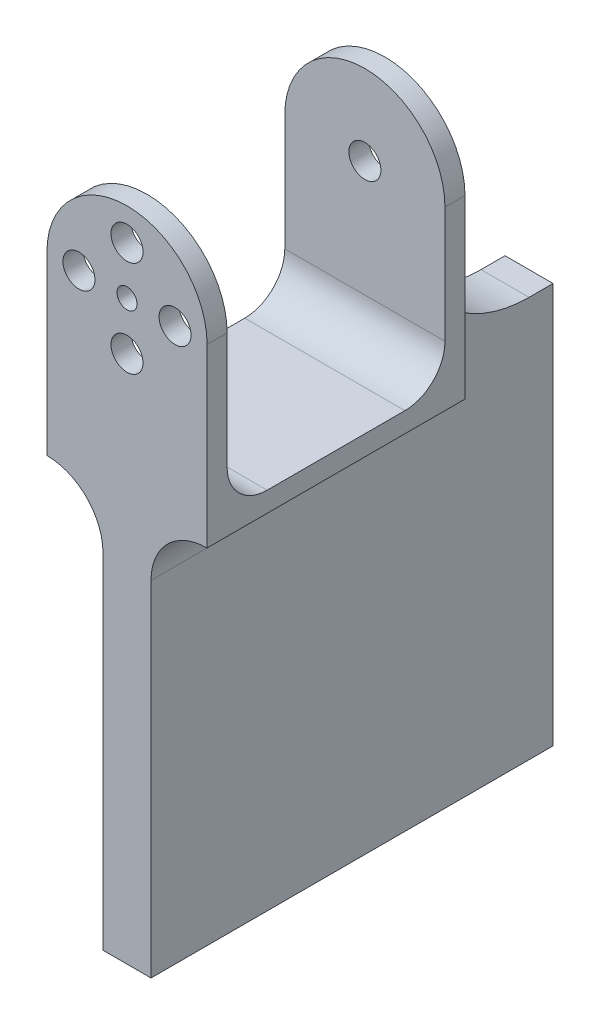
ISO-10303-21;
HEADER;
FILE_DESCRIPTION(('STEP AP214'),'2;1');
FILE_NAME('part.step','',(''),(''),'','','');
FILE_SCHEMA(('AUTOMOTIVE_DESIGN { 1 0 10303 214 1 1 1 1 }'));
ENDSEC;
DATA;
#1=APPLICATION_CONTEXT('core data for automotive mechanical design processes');
#2=APPLICATION_PROTOCOL_DEFINITION('international standard','automotive_design',2000,#1);
#3=PRODUCT_CONTEXT('',#1,'mechanical');
#4=PRODUCT('Part','Part','',(#3));
#5=PRODUCT_RELATED_PRODUCT_CATEGORY('part','',(#4));
#6=PRODUCT_DEFINITION_FORMATION('','',#4);
#7=PRODUCT_DEFINITION_CONTEXT('part definition',#1,'design');
#8=PRODUCT_DEFINITION('design','',#6,#7);
#9=PRODUCT_DEFINITION_SHAPE('','',#8);
#10=(LENGTH_UNIT() NAMED_UNIT(*) SI_UNIT(.MILLI.,.METRE.));
#11=(NAMED_UNIT(*) PLANE_ANGLE_UNIT() SI_UNIT($,.RADIAN.));
#12=(NAMED_UNIT(*) SI_UNIT($,.STERADIAN.) SOLID_ANGLE_UNIT());
#13=UNCERTAINTY_MEASURE_WITH_UNIT(LENGTH_MEASURE(1.E-05),#10,'distance_accuracy_value','');
#14=(GEOMETRIC_REPRESENTATION_CONTEXT(3) GLOBAL_UNCERTAINTY_ASSIGNED_CONTEXT((#13)) GLOBAL_UNIT_ASSIGNED_CONTEXT((#10,
#11,#12)) REPRESENTATION_CONTEXT('',''));
#15=CARTESIAN_POINT('',(0.,0.,0.));
#16=DIRECTION('',(0.,0.,1.));
#17=DIRECTION('',(1.,0.,0.));
#18=AXIS2_PLACEMENT_3D('',#15,#16,#17);
#19=CARTESIAN_POINT('',(0.,0.,2.5));
#20=DIRECTION('',(0.,0.,-1.));
#21=DIRECTION('',(-1.,0.,0.));
#22=AXIS2_PLACEMENT_3D('',#19,#20,#21);
#23=CYLINDRICAL_SURFACE('',#22,10.);
#24=CARTESIAN_POINT('',(0.,0.,0.));
#25=DIRECTION('',(0.,0.,-1.));
#26=DIRECTION('',(-1.,0.,0.));
#27=AXIS2_PLACEMENT_3D('',#24,#25,#26);
#28=CIRCLE('',#27,10.);
#29=CARTESIAN_POINT('',(-10.,0.,0.));
#30=VERTEX_POINT('',#29);
#31=CARTESIAN_POINT('',(10.,0.,0.));
#32=VERTEX_POINT('',#31);
#33=EDGE_CURVE('E326',#30,#32,#28,.T.);
#34=ORIENTED_EDGE('',*,*,#33,.F.);
#35=DIRECTION('',(0.,0.,1.));
#36=VECTOR('',#35,1.);
#37=CARTESIAN_POINT('',(-10.,0.,-29.732137494637));
#38=LINE('',#37,#36);
#39=CARTESIAN_POINT('',(-10.,0.,2.5));
#40=VERTEX_POINT('',#39);
#41=EDGE_CURVE('E277',#30,#40,#38,.T.);
#42=ORIENTED_EDGE('',*,*,#41,.T.);
#43=CARTESIAN_POINT('',(0.,0.,2.5));
#44=DIRECTION('',(0.,0.,-1.));
#45=DIRECTION('',(-1.,0.,0.));
#46=AXIS2_PLACEMENT_3D('',#43,#44,#45);
#47=CIRCLE('',#46,10.);
#48=CARTESIAN_POINT('',(10.,0.,2.5));
#49=VERTEX_POINT('',#48);
#50=EDGE_CURVE('E327',#40,#49,#47,.T.);
#51=ORIENTED_EDGE('',*,*,#50,.T.);
#52=DIRECTION('',(0.,0.,1.));
#53=VECTOR('',#52,1.);
#54=CARTESIAN_POINT('',(10.,0.,-29.732137494637));
#55=LINE('',#54,#53);
#56=EDGE_CURVE('E273',#32,#49,#55,.T.);
#57=ORIENTED_EDGE('',*,*,#56,.F.);
#58=EDGE_LOOP('',(#34,#42,#51,#57));
#59=FACE_BOUND('',#58,.T.);
#60=ADVANCED_FACE('F39',(#59),#23,.T.);
#61=CARTESIAN_POINT('',(0.,0.,2.5));
#62=DIRECTION('',(0.,0.,-1.));
#63=DIRECTION('',(-1.,0.,0.));
#64=AXIS2_PLACEMENT_3D('',#61,#62,#63);
#65=PLANE('',#64);
#66=CARTESIAN_POINT('',(6.,0.,2.5));
#67=DIRECTION('',(0.,0.,-1.));
#68=DIRECTION('',(-1.,0.,0.));
#69=AXIS2_PLACEMENT_3D('',#66,#67,#68);
#70=CIRCLE('',#69,2.);
#71=CARTESIAN_POINT('',(4.,0.,2.5));
#72=VERTEX_POINT('',#71);
#73=EDGE_CURVE('E306',#72,#72,#70,.T.);
#74=ORIENTED_EDGE('',*,*,#73,.T.);
#75=EDGE_LOOP('',(#74));
#76=FACE_BOUND('',#75,.T.);
#77=CARTESIAN_POINT('',(0.,-6.,2.5));
#78=DIRECTION('',(0.,0.,-1.));
#79=DIRECTION('',(-1.,0.,0.));
#80=AXIS2_PLACEMENT_3D('',#77,#78,#79);
#81=CIRCLE('',#80,2.);
#82=CARTESIAN_POINT('',(-2.,-6.,2.5));
#83=VERTEX_POINT('',#82);
#84=EDGE_CURVE('E302',#83,#83,#81,.T.);
#85=ORIENTED_EDGE('',*,*,#84,.T.);
#86=EDGE_LOOP('',(#85));
#87=FACE_BOUND('',#86,.T.);
#88=CARTESIAN_POINT('',(-6.,0.,2.5));
#89=DIRECTION('',(0.,0.,-1.));
#90=DIRECTION('',(-1.,0.,0.));
#91=AXIS2_PLACEMENT_3D('',#88,#89,#90);
#92=CIRCLE('',#91,2.);
#93=CARTESIAN_POINT('',(-8.,0.,2.5));
#94=VERTEX_POINT('',#93);
#95=EDGE_CURVE('E291',#94,#94,#92,.T.);
#96=ORIENTED_EDGE('',*,*,#95,.T.);
#97=EDGE_LOOP('',(#96));
#98=FACE_BOUND('',#97,.T.);
#99=CARTESIAN_POINT('',(0.,6.,2.5));
#100=DIRECTION('',(0.,0.,-1.));
#101=DIRECTION('',(-1.,0.,0.));
#102=AXIS2_PLACEMENT_3D('',#99,#100,#101);
#103=CIRCLE('',#102,2.);
#104=CARTESIAN_POINT('',(-2.,6.,2.5));
#105=VERTEX_POINT('',#104);
#106=EDGE_CURVE('E314',#105,#105,#103,.T.);
#107=ORIENTED_EDGE('',*,*,#106,.T.);
#108=EDGE_LOOP('',(#107));
#109=FACE_BOUND('',#108,.T.);
#110=CARTESIAN_POINT('',(0.,0.,2.5));
#111=DIRECTION('',(0.,0.,-1.));
#112=DIRECTION('',(-1.,0.,0.));
#113=AXIS2_PLACEMENT_3D('',#110,#111,#112);
#114=CIRCLE('',#113,1.25);
#115=CARTESIAN_POINT('',(-1.25,0.,2.5));
#116=VERTEX_POINT('',#115);
#117=EDGE_CURVE('E322',#116,#116,#114,.T.);
#118=ORIENTED_EDGE('',*,*,#117,.T.);
#119=EDGE_LOOP('',(#118));
#120=FACE_BOUND('',#119,.T.);
#121=ORIENTED_EDGE('',*,*,#50,.F.);
#122=DIRECTION('',(0.,-1.,0.));
#123=VECTOR('',#122,1.);
#124=CARTESIAN_POINT('',(-10.,0.,2.5));
#125=LINE('',#124,#123);
#126=CARTESIAN_POINT('',(-10.,-22.,2.5));
#127=VERTEX_POINT('',#126);
#128=EDGE_CURVE('E257',#40,#127,#125,.T.);
#129=ORIENTED_EDGE('',*,*,#128,.T.);
#130=CARTESIAN_POINT('',(-10.,-29.,2.5));
#131=DIRECTION('',(0.,0.,-1.));
#132=DIRECTION('',(-1.,0.,0.));
#133=AXIS2_PLACEMENT_3D('',#130,#131,#132);
#134=CIRCLE('',#133,7.);
#135=CARTESIAN_POINT('',(-3.,-29.,2.5));
#136=VERTEX_POINT('',#135);
#137=EDGE_CURVE('E373',#127,#136,#134,.T.);
#138=ORIENTED_EDGE('',*,*,#137,.T.);
#139=DIRECTION('',(0.,1.,0.));
#140=VECTOR('',#139,1.);
#141=CARTESIAN_POINT('',(-3.,-72.,2.5));
#142=LINE('',#141,#140);
#143=CARTESIAN_POINT('',(-3.,-72.,2.5));
#144=VERTEX_POINT('',#143);
#145=EDGE_CURVE('E205',#144,#136,#142,.T.);
#146=ORIENTED_EDGE('',*,*,#145,.F.);
#147=DIRECTION('',(-1.,0.,0.));
#148=VECTOR('',#147,1.);
#149=CARTESIAN_POINT('',(3.,-72.,2.5));
#150=LINE('',#149,#148);
#151=CARTESIAN_POINT('',(3.,-72.,2.5));
#152=VERTEX_POINT('',#151);
#153=EDGE_CURVE('E171',#152,#144,#150,.T.);
#154=ORIENTED_EDGE('',*,*,#153,.F.);
#155=DIRECTION('',(0.,1.,0.));
#156=VECTOR('',#155,1.);
#157=CARTESIAN_POINT('',(3.,-72.,2.5));
#158=LINE('',#157,#156);
#159=CARTESIAN_POINT('',(3.,-29.,2.5));
#160=VERTEX_POINT('',#159);
#161=EDGE_CURVE('E168',#152,#160,#158,.T.);
#162=ORIENTED_EDGE('',*,*,#161,.T.);
#163=CARTESIAN_POINT('',(10.,-29.,2.5));
#164=DIRECTION('',(0.,0.,-1.));
#165=DIRECTION('',(-1.,0.,0.));
#166=AXIS2_PLACEMENT_3D('',#163,#164,#165);
#167=CIRCLE('',#166,7.);
#168=CARTESIAN_POINT('',(10.,-22.,2.5));
#169=VERTEX_POINT('',#168);
#170=EDGE_CURVE('E376',#160,#169,#167,.T.);
#171=ORIENTED_EDGE('',*,*,#170,.T.);
#172=DIRECTION('',(0.,1.,0.));
#173=VECTOR('',#172,1.);
#174=CARTESIAN_POINT('',(10.,0.,2.5));
#175=LINE('',#174,#173);
#176=EDGE_CURVE('E258',#169,#49,#175,.T.);
#177=ORIENTED_EDGE('',*,*,#176,.T.);
#178=EDGE_LOOP('',(#121,#129,#138,#146,#154,#162,#171,#177));
#179=FACE_BOUND('',#178,.T.);
#180=ADVANCED_FACE('F409',(#76,#87,#98,#109,#120,#179),#65,.F.);
#181=CARTESIAN_POINT('',(0.,0.,0.));
#182=DIRECTION('',(0.,0.,-1.));
#183=DIRECTION('',(-1.,0.,0.));
#184=AXIS2_PLACEMENT_3D('',#181,#182,#183);
#185=PLANE('',#184);
#186=DIRECTION('',(0.,1.,0.));
#187=VECTOR('',#186,1.);
#188=CARTESIAN_POINT('',(10.,0.,0.));
#189=LINE('',#188,#187);
#190=CARTESIAN_POINT('',(10.,-14.5,0.));
#191=VERTEX_POINT('',#190);
#192=EDGE_CURVE('E270',#191,#32,#189,.T.);
#193=ORIENTED_EDGE('',*,*,#192,.F.);
#194=DIRECTION('',(1.,0.,0.));
#195=VECTOR('',#194,1.);
#196=CARTESIAN_POINT('',(0.,-14.5,0.));
#197=LINE('',#196,#195);
#198=CARTESIAN_POINT('',(-10.,-14.5,0.));
#199=VERTEX_POINT('',#198);
#200=EDGE_CURVE('E341',#191,#199,#197,.F.);
#201=ORIENTED_EDGE('',*,*,#200,.T.);
#202=DIRECTION('',(0.,-1.,0.));
#203=VECTOR('',#202,1.);
#204=CARTESIAN_POINT('',(-10.,0.,0.));
#205=LINE('',#204,#203);
#206=EDGE_CURVE('E262',#30,#199,#205,.T.);
#207=ORIENTED_EDGE('',*,*,#206,.F.);
#208=ORIENTED_EDGE('',*,*,#33,.T.);
#209=EDGE_LOOP('',(#193,#201,#207,#208));
#210=FACE_BOUND('',#209,.T.);
#211=CARTESIAN_POINT('',(6.,0.,0.));
#212=DIRECTION('',(0.,0.,-1.));
#213=DIRECTION('',(0.,1.,0.));
#214=AXIS2_PLACEMENT_3D('',#211,#212,#213);
#215=CIRCLE('',#214,2.);
#216=CARTESIAN_POINT('',(6.00000000000001,1.99999999999998,0.));
#217=VERTEX_POINT('',#216);
#218=EDGE_CURVE('E287',#217,#217,#215,.T.);
#219=ORIENTED_EDGE('',*,*,#218,.F.);
#220=EDGE_LOOP('',(#219));
#221=FACE_BOUND('',#220,.T.);
#222=CARTESIAN_POINT('',(0.,-6.,0.));
#223=DIRECTION('',(0.,0.,-1.));
#224=DIRECTION('',(1.,0.,0.));
#225=AXIS2_PLACEMENT_3D('',#222,#223,#224);
#226=CIRCLE('',#225,2.);
#227=CARTESIAN_POINT('',(2.,-6.,0.));
#228=VERTEX_POINT('',#227);
#229=EDGE_CURVE('E292',#228,#228,#226,.T.);
#230=ORIENTED_EDGE('',*,*,#229,.F.);
#231=EDGE_LOOP('',(#230));
#232=FACE_BOUND('',#231,.T.);
#233=CARTESIAN_POINT('',(-6.,0.,0.));
#234=DIRECTION('',(0.,0.,-1.));
#235=DIRECTION('',(0.,-1.,0.));
#236=AXIS2_PLACEMENT_3D('',#233,#234,#235);
#237=CIRCLE('',#236,2.);
#238=CARTESIAN_POINT('',(-6.00000000000002,-1.99999999999994,0.));
#239=VERTEX_POINT('',#238);
#240=EDGE_CURVE('E286',#239,#239,#237,.T.);
#241=ORIENTED_EDGE('',*,*,#240,.F.);
#242=EDGE_LOOP('',(#241));
#243=FACE_BOUND('',#242,.T.);
#244=CARTESIAN_POINT('',(0.,6.,0.));
#245=DIRECTION('',(0.,0.,-1.));
#246=DIRECTION('',(-1.,0.,0.));
#247=AXIS2_PLACEMENT_3D('',#244,#245,#246);
#248=CIRCLE('',#247,2.);
#249=CARTESIAN_POINT('',(-2.,6.,0.));
#250=VERTEX_POINT('',#249);
#251=EDGE_CURVE('E310',#250,#250,#248,.T.);
#252=ORIENTED_EDGE('',*,*,#251,.F.);
#253=EDGE_LOOP('',(#252));
#254=FACE_BOUND('',#253,.T.);
#255=CARTESIAN_POINT('',(0.,0.,0.));
#256=DIRECTION('',(0.,0.,-1.));
#257=DIRECTION('',(-1.,0.,0.));
#258=AXIS2_PLACEMENT_3D('',#255,#256,#257);
#259=CIRCLE('',#258,1.25);
#260=CARTESIAN_POINT('',(-1.25,0.,0.));
#261=VERTEX_POINT('',#260);
#262=EDGE_CURVE('E318',#261,#261,#259,.T.);
#263=ORIENTED_EDGE('',*,*,#262,.F.);
#264=EDGE_LOOP('',(#263));
#265=FACE_BOUND('',#264,.T.);
#266=ADVANCED_FACE('F418',(#210,#221,#232,#243,#254,#265),#185,.T.);
#267=CARTESIAN_POINT('',(0.,0.,10.));
#268=DIRECTION('',(0.,0.,-1.));
#269=DIRECTION('',(-1.,0.,0.));
#270=AXIS2_PLACEMENT_3D('',#267,#268,#269);
#271=CYLINDRICAL_SURFACE('',#270,1.25);
#272=ORIENTED_EDGE('',*,*,#262,.T.);
#273=EDGE_LOOP('',(#272));
#274=FACE_BOUND('',#273,.T.);
#275=ORIENTED_EDGE('',*,*,#117,.F.);
#276=EDGE_LOOP('',(#275));
#277=FACE_BOUND('',#276,.T.);
#278=ADVANCED_FACE('F600',(#274,#277),#271,.F.);
#279=CARTESIAN_POINT('',(0.,6.,10.));
#280=DIRECTION('',(0.,0.,-1.));
#281=DIRECTION('',(-1.,0.,0.));
#282=AXIS2_PLACEMENT_3D('',#279,#280,#281);
#283=CYLINDRICAL_SURFACE('',#282,2.);
#284=ORIENTED_EDGE('',*,*,#251,.T.);
#285=EDGE_LOOP('',(#284));
#286=FACE_BOUND('',#285,.T.);
#287=ORIENTED_EDGE('',*,*,#106,.F.);
#288=EDGE_LOOP('',(#287));
#289=FACE_BOUND('',#288,.T.);
#290=ADVANCED_FACE('F648',(#286,#289),#283,.F.);
#291=CARTESIAN_POINT('',(-6.,0.,10.));
#292=DIRECTION('',(0.,0.,-1.));
#293=DIRECTION('',(-1.,0.,0.));
#294=AXIS2_PLACEMENT_3D('',#291,#292,#293);
#295=CYLINDRICAL_SURFACE('',#294,2.);
#296=ORIENTED_EDGE('',*,*,#240,.T.);
#297=EDGE_LOOP('',(#296));
#298=FACE_BOUND('',#297,.T.);
#299=ORIENTED_EDGE('',*,*,#95,.F.);
#300=EDGE_LOOP('',(#299));
#301=FACE_BOUND('',#300,.T.);
#302=ADVANCED_FACE('F638',(#298,#301),#295,.F.);
#303=CARTESIAN_POINT('',(0.,-6.,10.));
#304=DIRECTION('',(0.,0.,-1.));
#305=DIRECTION('',(-1.,0.,0.));
#306=AXIS2_PLACEMENT_3D('',#303,#304,#305);
#307=CYLINDRICAL_SURFACE('',#306,2.);
#308=ORIENTED_EDGE('',*,*,#229,.T.);
#309=EDGE_LOOP('',(#308));
#310=FACE_BOUND('',#309,.T.);
#311=ORIENTED_EDGE('',*,*,#84,.F.);
#312=EDGE_LOOP('',(#311));
#313=FACE_BOUND('',#312,.T.);
#314=ADVANCED_FACE('F628',(#310,#313),#307,.F.);
#315=CARTESIAN_POINT('',(6.,0.,10.));
#316=DIRECTION('',(0.,0.,-1.));
#317=DIRECTION('',(-1.,0.,0.));
#318=AXIS2_PLACEMENT_3D('',#315,#316,#317);
#319=CYLINDRICAL_SURFACE('',#318,2.);
#320=ORIENTED_EDGE('',*,*,#218,.T.);
#321=EDGE_LOOP('',(#320));
#322=FACE_BOUND('',#321,.T.);
#323=ORIENTED_EDGE('',*,*,#73,.F.);
#324=EDGE_LOOP('',(#323));
#325=FACE_BOUND('',#324,.T.);
#326=ADVANCED_FACE('F545',(#322,#325),#319,.F.);
#327=CARTESIAN_POINT('',(-10.,0.,-29.732137494637));
#328=DIRECTION('',(-1.,0.,0.));
#329=DIRECTION('',(0.,-1.,0.));
#330=AXIS2_PLACEMENT_3D('',#327,#328,#329);
#331=PLANE('',#330);
#332=ORIENTED_EDGE('',*,*,#41,.F.);
#333=ORIENTED_EDGE('',*,*,#206,.T.);
#334=CARTESIAN_POINT('',(-10.,-14.5,-5.));
#335=DIRECTION('',(-1.,0.,0.));
#336=DIRECTION('',(0.,-1.,0.));
#337=AXIS2_PLACEMENT_3D('',#334,#335,#336);
#338=CIRCLE('',#337,5.);
#339=CARTESIAN_POINT('',(-10.,-19.5,-5.));
#340=VERTEX_POINT('',#339);
#341=EDGE_CURVE('E351',#199,#340,#338,.F.);
#342=ORIENTED_EDGE('',*,*,#341,.T.);
#343=DIRECTION('',(0.,0.,1.));
#344=VECTOR('',#343,1.);
#345=CARTESIAN_POINT('',(-10.,-19.5,-27.2));
#346=LINE('',#345,#344);
#347=CARTESIAN_POINT('',(-10.,-19.5,-22.2));
#348=VERTEX_POINT('',#347);
#349=EDGE_CURVE('E253',#348,#340,#346,.T.);
#350=ORIENTED_EDGE('',*,*,#349,.F.);
#351=CARTESIAN_POINT('',(-10.,-14.5,-22.2));
#352=DIRECTION('',(-1.,0.,0.));
#353=DIRECTION('',(0.,-1.,0.));
#354=AXIS2_PLACEMENT_3D('',#351,#352,#353);
#355=CIRCLE('',#354,5.);
#356=CARTESIAN_POINT('',(-10.,-14.5,-27.2));
#357=VERTEX_POINT('',#356);
#358=EDGE_CURVE('E357',#348,#357,#355,.F.);
#359=ORIENTED_EDGE('',*,*,#358,.T.);
#360=DIRECTION('',(0.,1.,0.));
#361=VECTOR('',#360,1.);
#362=CARTESIAN_POINT('',(-10.,0.,-27.2));
#363=LINE('',#362,#361);
#364=CARTESIAN_POINT('',(-10.,0.,-27.2));
#365=VERTEX_POINT('',#364);
#366=EDGE_CURVE('E225',#357,#365,#363,.T.);
#367=ORIENTED_EDGE('',*,*,#366,.T.);
#368=DIRECTION('',(0.,0.,1.));
#369=VECTOR('',#368,1.);
#370=CARTESIAN_POINT('',(-10.,0.,-29.7));
#371=LINE('',#370,#369);
#372=CARTESIAN_POINT('',(-10.,0.,-29.7));
#373=VERTEX_POINT('',#372);
#374=EDGE_CURVE('E232',#373,#365,#371,.T.);
#375=ORIENTED_EDGE('',*,*,#374,.F.);
#376=DIRECTION('',(0.,1.,0.));
#377=VECTOR('',#376,1.);
#378=CARTESIAN_POINT('',(-10.,0.,-29.7));
#379=LINE('',#378,#377);
#380=CARTESIAN_POINT('',(-10.,-22.,-29.7));
#381=VERTEX_POINT('',#380);
#382=EDGE_CURVE('E229',#381,#373,#379,.T.);
#383=ORIENTED_EDGE('',*,*,#382,.F.);
#384=DIRECTION('',(0.,0.,1.));
#385=VECTOR('',#384,1.);
#386=CARTESIAN_POINT('',(-10.,-22.,-29.732137494637));
#387=LINE('',#386,#385);
#388=EDGE_CURVE('E269',#381,#127,#387,.T.);
#389=ORIENTED_EDGE('',*,*,#388,.T.);
#390=ORIENTED_EDGE('',*,*,#128,.F.);
#391=EDGE_LOOP('',(#332,#333,#342,#350,#359,#367,#375,#383,#389,#390));
#392=FACE_BOUND('',#391,.T.);
#393=ADVANCED_FACE('F405',(#392),#331,.T.);
#394=CARTESIAN_POINT('',(10.,0.,-29.732137494637));
#395=DIRECTION('',(1.,0.,0.));
#396=DIRECTION('',(0.,1.,0.));
#397=AXIS2_PLACEMENT_3D('',#394,#395,#396);
#398=PLANE('',#397);
#399=DIRECTION('',(0.,0.,1.));
#400=VECTOR('',#399,1.);
#401=CARTESIAN_POINT('',(10.,-22.,-29.732137494637));
#402=LINE('',#401,#400);
#403=CARTESIAN_POINT('',(10.,-22.,-29.7));
#404=VERTEX_POINT('',#403);
#405=EDGE_CURVE('E274',#404,#169,#402,.T.);
#406=ORIENTED_EDGE('',*,*,#405,.F.);
#407=DIRECTION('',(0.,-1.,0.));
#408=VECTOR('',#407,1.);
#409=CARTESIAN_POINT('',(10.,0.,-29.7));
#410=LINE('',#409,#408);
#411=CARTESIAN_POINT('',(10.,0.,-29.7));
#412=VERTEX_POINT('',#411);
#413=EDGE_CURVE('E224',#412,#404,#410,.T.);
#414=ORIENTED_EDGE('',*,*,#413,.F.);
#415=DIRECTION('',(0.,0.,1.));
#416=VECTOR('',#415,1.);
#417=CARTESIAN_POINT('',(10.,0.,-29.7));
#418=LINE('',#417,#416);
#419=CARTESIAN_POINT('',(10.,0.,-27.2));
#420=VERTEX_POINT('',#419);
#421=EDGE_CURVE('E245',#412,#420,#418,.T.);
#422=ORIENTED_EDGE('',*,*,#421,.T.);
#423=DIRECTION('',(0.,-1.,0.));
#424=VECTOR('',#423,1.);
#425=CARTESIAN_POINT('',(10.,0.,-27.2));
#426=LINE('',#425,#424);
#427=CARTESIAN_POINT('',(10.,-14.5,-27.2));
#428=VERTEX_POINT('',#427);
#429=EDGE_CURVE('E236',#420,#428,#426,.T.);
#430=ORIENTED_EDGE('',*,*,#429,.T.);
#431=CARTESIAN_POINT('',(10.,-14.5,-22.2));
#432=DIRECTION('',(1.,0.,0.));
#433=DIRECTION('',(0.,1.,0.));
#434=AXIS2_PLACEMENT_3D('',#431,#432,#433);
#435=CIRCLE('',#434,5.);
#436=CARTESIAN_POINT('',(10.,-19.5,-22.2));
#437=VERTEX_POINT('',#436);
#438=EDGE_CURVE('E354',#428,#437,#435,.F.);
#439=ORIENTED_EDGE('',*,*,#438,.T.);
#440=DIRECTION('',(0.,0.,1.));
#441=VECTOR('',#440,1.);
#442=CARTESIAN_POINT('',(10.,-19.5,-27.2));
#443=LINE('',#442,#441);
#444=CARTESIAN_POINT('',(10.,-19.5,-5.));
#445=VERTEX_POINT('',#444);
#446=EDGE_CURVE('E249',#437,#445,#443,.T.);
#447=ORIENTED_EDGE('',*,*,#446,.T.);
#448=CARTESIAN_POINT('',(10.,-14.5,-5.));
#449=DIRECTION('',(1.,0.,0.));
#450=DIRECTION('',(0.,1.,0.));
#451=AXIS2_PLACEMENT_3D('',#448,#449,#450);
#452=CIRCLE('',#451,5.);
#453=EDGE_CURVE('E348',#445,#191,#452,.F.);
#454=ORIENTED_EDGE('',*,*,#453,.T.);
#455=ORIENTED_EDGE('',*,*,#192,.T.);
#456=ORIENTED_EDGE('',*,*,#56,.T.);
#457=ORIENTED_EDGE('',*,*,#176,.F.);
#458=EDGE_LOOP('',(#406,#414,#422,#430,#439,#447,#454,#455,#456,#457));
#459=FACE_BOUND('',#458,.T.);
#460=ADVANCED_FACE('F529',(#459),#398,.T.);
#461=CARTESIAN_POINT('',(-10.,-19.5,-27.2));
#462=DIRECTION('',(0.,-1.,0.));
#463=DIRECTION('',(1.,0.,0.));
#464=AXIS2_PLACEMENT_3D('',#461,#462,#463);
#465=PLANE('',#464);
#466=ORIENTED_EDGE('',*,*,#349,.T.);
#467=DIRECTION('',(1.,0.,0.));
#468=VECTOR('',#467,1.);
#469=CARTESIAN_POINT('',(-10.,-19.5,-5.));
#470=LINE('',#469,#468);
#471=EDGE_CURVE('E337',#340,#445,#470,.T.);
#472=ORIENTED_EDGE('',*,*,#471,.T.);
#473=ORIENTED_EDGE('',*,*,#446,.F.);
#474=DIRECTION('',(1.,0.,0.));
#475=VECTOR('',#474,1.);
#476=CARTESIAN_POINT('',(-10.,-19.5,-22.2));
#477=LINE('',#476,#475);
#478=EDGE_CURVE('E331',#437,#348,#477,.F.);
#479=ORIENTED_EDGE('',*,*,#478,.T.);
#480=EDGE_LOOP('',(#466,#472,#473,#479));
#481=FACE_BOUND('',#480,.T.);
#482=ADVANCED_FACE('F427',(#481),#465,.F.);
#483=CARTESIAN_POINT('',(0.,0.,-27.2));
#484=DIRECTION('',(0.,0.,-1.));
#485=DIRECTION('',(-1.,0.,0.));
#486=AXIS2_PLACEMENT_3D('',#483,#484,#485);
#487=PLANE('',#486);
#488=CARTESIAN_POINT('',(0.,0.,-27.2));
#489=DIRECTION('',(0.,0.,-1.));
#490=DIRECTION('',(-1.,0.,0.));
#491=AXIS2_PLACEMENT_3D('',#488,#489,#490);
#492=CIRCLE('',#491,2.);
#493=CARTESIAN_POINT('',(-2.,0.,-27.2));
#494=VERTEX_POINT('',#493);
#495=EDGE_CURVE('E211',#494,#494,#492,.T.);
#496=ORIENTED_EDGE('',*,*,#495,.T.);
#497=EDGE_LOOP('',(#496));
#498=FACE_BOUND('',#497,.T.);
#499=ORIENTED_EDGE('',*,*,#366,.F.);
#500=DIRECTION('',(1.,0.,0.));
#501=VECTOR('',#500,1.);
#502=CARTESIAN_POINT('',(10.,-14.5,-27.2));
#503=LINE('',#502,#501);
#504=EDGE_CURVE('E344',#357,#428,#503,.T.);
#505=ORIENTED_EDGE('',*,*,#504,.T.);
#506=ORIENTED_EDGE('',*,*,#429,.F.);
#507=CARTESIAN_POINT('',(0.,0.,-27.2));
#508=DIRECTION('',(0.,0.,-1.));
#509=DIRECTION('',(-1.,0.,0.));
#510=AXIS2_PLACEMENT_3D('',#507,#508,#509);
#511=CIRCLE('',#510,10.);
#512=EDGE_CURVE('E216',#365,#420,#511,.T.);
#513=ORIENTED_EDGE('',*,*,#512,.F.);
#514=EDGE_LOOP('',(#499,#505,#506,#513));
#515=FACE_BOUND('',#514,.T.);
#516=ADVANCED_FACE('F436',(#498,#515),#487,.F.);
#517=CARTESIAN_POINT('',(0.,0.,-29.7));
#518=DIRECTION('',(0.,0.,-1.));
#519=DIRECTION('',(-1.,0.,0.));
#520=AXIS2_PLACEMENT_3D('',#517,#518,#519);
#521=PLANE('',#520);
#522=DIRECTION('',(0.,-1.,0.));
#523=VECTOR('',#522,1.);
#524=CARTESIAN_POINT('',(3.,-72.,-29.7));
#525=LINE('',#524,#523);
#526=CARTESIAN_POINT('',(3.,-7.00000000000001,-29.7));
#527=VERTEX_POINT('',#526);
#528=CARTESIAN_POINT('',(3.,-29.,-29.7));
#529=VERTEX_POINT('',#528);
#530=EDGE_CURVE('E55',#527,#529,#525,.T.);
#531=ORIENTED_EDGE('',*,*,#530,.F.);
#532=DIRECTION('',(1.,0.,0.));
#533=VECTOR('',#532,1.);
#534=CARTESIAN_POINT('',(0.,-7.,-29.7));
#535=LINE('',#534,#533);
#536=CARTESIAN_POINT('',(-3.,-7.00000000000001,-29.7));
#537=VERTEX_POINT('',#536);
#538=EDGE_CURVE('E386',#527,#537,#535,.F.);
#539=ORIENTED_EDGE('',*,*,#538,.T.);
#540=DIRECTION('',(0.,1.,0.));
#541=VECTOR('',#540,1.);
#542=CARTESIAN_POINT('',(-3.,-72.,-29.7));
#543=LINE('',#542,#541);
#544=CARTESIAN_POINT('',(-3.,-29.,-29.7));
#545=VERTEX_POINT('',#544);
#546=EDGE_CURVE('E62',#545,#537,#543,.T.);
#547=ORIENTED_EDGE('',*,*,#546,.F.);
#548=CARTESIAN_POINT('',(-10.,-29.,-29.7));
#549=DIRECTION('',(0.,0.,-1.));
#550=DIRECTION('',(-1.,0.,0.));
#551=AXIS2_PLACEMENT_3D('',#548,#549,#550);
#552=CIRCLE('',#551,7.);
#553=EDGE_CURVE('E370',#545,#381,#552,.F.);
#554=ORIENTED_EDGE('',*,*,#553,.T.);
#555=ORIENTED_EDGE('',*,*,#382,.T.);
#556=CARTESIAN_POINT('',(0.,0.,-29.7));
#557=DIRECTION('',(0.,0.,-1.));
#558=DIRECTION('',(-1.,0.,0.));
#559=AXIS2_PLACEMENT_3D('',#556,#557,#558);
#560=CIRCLE('',#559,10.);
#561=EDGE_CURVE('E220',#373,#412,#560,.T.);
#562=ORIENTED_EDGE('',*,*,#561,.T.);
#563=ORIENTED_EDGE('',*,*,#413,.T.);
#564=CARTESIAN_POINT('',(10.,-29.,-29.7));
#565=DIRECTION('',(0.,0.,-1.));
#566=DIRECTION('',(-1.,0.,0.));
#567=AXIS2_PLACEMENT_3D('',#564,#565,#566);
#568=CIRCLE('',#567,7.);
#569=EDGE_CURVE('E379',#404,#529,#568,.F.);
#570=ORIENTED_EDGE('',*,*,#569,.T.);
#571=EDGE_LOOP('',(#531,#539,#547,#554,#555,#562,#563,#570));
#572=FACE_BOUND('',#571,.T.);
#573=CARTESIAN_POINT('',(0.,0.,-29.7));
#574=DIRECTION('',(0.,0.,-1.));
#575=DIRECTION('',(-1.,0.,0.));
#576=AXIS2_PLACEMENT_3D('',#573,#574,#575);
#577=CIRCLE('',#576,2.);
#578=CARTESIAN_POINT('',(-2.,0.,-29.7));
#579=VERTEX_POINT('',#578);
#580=EDGE_CURVE('E212',#579,#579,#577,.T.);
#581=ORIENTED_EDGE('',*,*,#580,.F.);
#582=EDGE_LOOP('',(#581));
#583=FACE_BOUND('',#582,.T.);
#584=ADVANCED_FACE('F394',(#572,#583),#521,.T.);
#585=CARTESIAN_POINT('',(0.,0.,-29.7));
#586=DIRECTION('',(0.,0.,1.));
#587=DIRECTION('',(1.,0.,0.));
#588=AXIS2_PLACEMENT_3D('',#585,#586,#587);
#589=CYLINDRICAL_SURFACE('',#588,10.);
#590=ORIENTED_EDGE('',*,*,#512,.T.);
#591=ORIENTED_EDGE('',*,*,#421,.F.);
#592=ORIENTED_EDGE('',*,*,#561,.F.);
#593=ORIENTED_EDGE('',*,*,#374,.T.);
#594=EDGE_LOOP('',(#590,#591,#592,#593));
#595=FACE_BOUND('',#594,.T.);
#596=ADVANCED_FACE('F439',(#595),#589,.T.);
#597=CARTESIAN_POINT('',(0.,0.,-29.7));
#598=DIRECTION('',(0.,0.,1.));
#599=DIRECTION('',(1.,0.,0.));
#600=AXIS2_PLACEMENT_3D('',#597,#598,#599);
#601=CYLINDRICAL_SURFACE('',#600,2.);
#602=ORIENTED_EDGE('',*,*,#580,.T.);
#603=EDGE_LOOP('',(#602));
#604=FACE_BOUND('',#603,.T.);
#605=ORIENTED_EDGE('',*,*,#495,.F.);
#606=EDGE_LOOP('',(#605));
#607=FACE_BOUND('',#606,.T.);
#608=ADVANCED_FACE('F467',(#604,#607),#601,.F.);
#609=CARTESIAN_POINT('',(-10.,-14.5,-5.));
#610=DIRECTION('',(1.,0.,0.));
#611=DIRECTION('',(0.,1.,0.));
#612=AXIS2_PLACEMENT_3D('',#609,#610,#611);
#613=CYLINDRICAL_SURFACE('',#612,5.);
#614=ORIENTED_EDGE('',*,*,#341,.F.);
#615=ORIENTED_EDGE('',*,*,#200,.F.);
#616=ORIENTED_EDGE('',*,*,#453,.F.);
#617=ORIENTED_EDGE('',*,*,#471,.F.);
#618=EDGE_LOOP('',(#614,#615,#616,#617));
#619=FACE_BOUND('',#618,.T.);
#620=ADVANCED_FACE('F422',(#619),#613,.F.);
#621=CARTESIAN_POINT('',(0.,-14.5,-22.2));
#622=DIRECTION('',(-1.,0.,0.));
#623=DIRECTION('',(0.,-1.,0.));
#624=AXIS2_PLACEMENT_3D('',#621,#622,#623);
#625=CYLINDRICAL_SURFACE('',#624,5.);
#626=ORIENTED_EDGE('',*,*,#358,.F.);
#627=ORIENTED_EDGE('',*,*,#478,.F.);
#628=ORIENTED_EDGE('',*,*,#438,.F.);
#629=ORIENTED_EDGE('',*,*,#504,.F.);
#630=EDGE_LOOP('',(#626,#627,#628,#629));
#631=FACE_BOUND('',#630,.T.);
#632=ADVANCED_FACE('F431',(#631),#625,.F.);
#633=CARTESIAN_POINT('',(3.,-72.,-29.7));
#634=DIRECTION('',(-1.,0.,0.));
#635=DIRECTION('',(0.,0.,1.));
#636=AXIS2_PLACEMENT_3D('',#633,#634,#635);
#637=PLANE('',#636);
#638=ORIENTED_EDGE('',*,*,#530,.T.);
#639=DIRECTION('',(0.,0.,1.));
#640=VECTOR('',#639,1.);
#641=CARTESIAN_POINT('',(3.,-29.,-29.7));
#642=LINE('',#641,#640);
#643=EDGE_CURVE('E367',#529,#160,#642,.T.);
#644=ORIENTED_EDGE('',*,*,#643,.T.);
#645=ORIENTED_EDGE('',*,*,#161,.F.);
#646=DIRECTION('',(0.,0.,1.));
#647=VECTOR('',#646,1.);
#648=CARTESIAN_POINT('',(3.,-72.,-29.7));
#649=LINE('',#648,#647);
#650=CARTESIAN_POINT('',(3.,-72.,-47.7));
#651=VERTEX_POINT('',#650);
#652=EDGE_CURVE('E160',#651,#152,#649,.T.);
#653=ORIENTED_EDGE('',*,*,#652,.F.);
#654=DIRECTION('',(0.,-1.,0.));
#655=VECTOR('',#654,1.);
#656=CARTESIAN_POINT('',(3.,-72.,-47.7));
#657=LINE('',#656,#655);
#658=CARTESIAN_POINT('',(3.,-22.,-47.7));
#659=VERTEX_POINT('',#658);
#660=EDGE_CURVE('E165',#659,#651,#657,.T.);
#661=ORIENTED_EDGE('',*,*,#660,.F.);
#662=DIRECTION('',(0.,0.,1.));
#663=VECTOR('',#662,1.);
#664=CARTESIAN_POINT('',(3.,-22.,-47.7));
#665=LINE('',#664,#663);
#666=CARTESIAN_POINT('',(3.,-22.,-44.7));
#667=VERTEX_POINT('',#666);
#668=EDGE_CURVE('E195',#659,#667,#665,.T.);
#669=ORIENTED_EDGE('',*,*,#668,.T.);
#670=CARTESIAN_POINT('',(3.,-7.00000000000001,-44.7));
#671=DIRECTION('',(-1.,0.,0.));
#672=DIRECTION('',(0.,0.,1.));
#673=AXIS2_PLACEMENT_3D('',#670,#671,#672);
#674=CIRCLE('',#673,15.);
#675=EDGE_CURVE('E48',#667,#527,#674,.T.);
#676=ORIENTED_EDGE('',*,*,#675,.T.);
#677=EDGE_LOOP('',(#638,#644,#645,#653,#661,#669,#676));
#678=FACE_BOUND('',#677,.T.);
#679=ADVANCED_FACE('F162',(#678),#637,.F.);
#680=CARTESIAN_POINT('',(-3.,-72.,-29.7));
#681=DIRECTION('',(1.,0.,0.));
#682=DIRECTION('',(0.,0.,-1.));
#683=AXIS2_PLACEMENT_3D('',#680,#681,#682);
#684=PLANE('',#683);
#685=ORIENTED_EDGE('',*,*,#145,.T.);
#686=DIRECTION('',(0.,0.,-1.));
#687=VECTOR('',#686,1.);
#688=CARTESIAN_POINT('',(-3.,-29.,-29.7));
#689=LINE('',#688,#687);
#690=EDGE_CURVE('E362',#136,#545,#689,.T.);
#691=ORIENTED_EDGE('',*,*,#690,.T.);
#692=ORIENTED_EDGE('',*,*,#546,.T.);
#693=CARTESIAN_POINT('',(-3.,-7.,-44.7));
#694=DIRECTION('',(1.,0.,0.));
#695=DIRECTION('',(0.,0.,-1.));
#696=AXIS2_PLACEMENT_3D('',#693,#694,#695);
#697=CIRCLE('',#696,15.);
#698=CARTESIAN_POINT('',(-3.,-22.,-44.7));
#699=VERTEX_POINT('',#698);
#700=EDGE_CURVE('E11',#537,#699,#697,.T.);
#701=ORIENTED_EDGE('',*,*,#700,.T.);
#702=DIRECTION('',(0.,0.,1.));
#703=VECTOR('',#702,1.);
#704=CARTESIAN_POINT('',(-3.,-22.,-47.7));
#705=LINE('',#704,#703);
#706=CARTESIAN_POINT('',(-3.,-22.,-47.7));
#707=VERTEX_POINT('',#706);
#708=EDGE_CURVE('E172',#707,#699,#705,.T.);
#709=ORIENTED_EDGE('',*,*,#708,.F.);
#710=DIRECTION('',(0.,1.,0.));
#711=VECTOR('',#710,1.);
#712=CARTESIAN_POINT('',(-3.,-72.,-47.7));
#713=LINE('',#712,#711);
#714=CARTESIAN_POINT('',(-3.,-72.,-47.7));
#715=VERTEX_POINT('',#714);
#716=EDGE_CURVE('E182',#715,#707,#713,.T.);
#717=ORIENTED_EDGE('',*,*,#716,.F.);
#718=DIRECTION('',(0.,0.,-1.));
#719=VECTOR('',#718,1.);
#720=CARTESIAN_POINT('',(-3.,-72.,-29.7));
#721=LINE('',#720,#719);
#722=EDGE_CURVE('E178',#144,#715,#721,.T.);
#723=ORIENTED_EDGE('',*,*,#722,.F.);
#724=EDGE_LOOP('',(#685,#691,#692,#701,#709,#717,#723));
#725=FACE_BOUND('',#724,.T.);
#726=ADVANCED_FACE('F398',(#725),#684,.F.);
#727=CARTESIAN_POINT('',(0.,-72.,0.));
#728=DIRECTION('',(0.,-1.,0.));
#729=DIRECTION('',(0.,0.,-1.));
#730=AXIS2_PLACEMENT_3D('',#727,#728,#729);
#731=PLANE('',#730);
#732=ORIENTED_EDGE('',*,*,#652,.T.);
#733=ORIENTED_EDGE('',*,*,#153,.T.);
#734=ORIENTED_EDGE('',*,*,#722,.T.);
#735=DIRECTION('',(-1.,0.,0.));
#736=VECTOR('',#735,1.);
#737=CARTESIAN_POINT('',(3.,-72.,-47.7));
#738=LINE('',#737,#736);
#739=EDGE_CURVE('E175',#651,#715,#738,.T.);
#740=ORIENTED_EDGE('',*,*,#739,.F.);
#741=EDGE_LOOP('',(#732,#733,#734,#740));
#742=FACE_BOUND('',#741,.T.);
#743=ADVANCED_FACE('F176',(#742),#731,.T.);
#744=CARTESIAN_POINT('',(3.,-22.,-47.7));
#745=DIRECTION('',(0.,-1.,0.));
#746=DIRECTION('',(1.,0.,0.));
#747=AXIS2_PLACEMENT_3D('',#744,#745,#746);
#748=PLANE('',#747);
#749=ORIENTED_EDGE('',*,*,#708,.T.);
#750=DIRECTION('',(1.,0.,0.));
#751=VECTOR('',#750,1.);
#752=CARTESIAN_POINT('',(3.,-22.,-44.7));
#753=LINE('',#752,#751);
#754=EDGE_CURVE('E382',#699,#667,#753,.T.);
#755=ORIENTED_EDGE('',*,*,#754,.T.);
#756=ORIENTED_EDGE('',*,*,#668,.F.);
#757=DIRECTION('',(1.,0.,0.));
#758=VECTOR('',#757,1.);
#759=CARTESIAN_POINT('',(3.,-22.,-47.7));
#760=LINE('',#759,#758);
#761=EDGE_CURVE('E186',#707,#659,#760,.T.);
#762=ORIENTED_EDGE('',*,*,#761,.F.);
#763=EDGE_LOOP('',(#749,#755,#756,#762));
#764=FACE_BOUND('',#763,.T.);
#765=ADVANCED_FACE('F447',(#764),#748,.F.);
#766=CARTESIAN_POINT('',(0.,0.,-47.7));
#767=DIRECTION('',(0.,0.,1.));
#768=DIRECTION('',(1.,0.,0.));
#769=AXIS2_PLACEMENT_3D('',#766,#767,#768);
#770=PLANE('',#769);
#771=ORIENTED_EDGE('',*,*,#660,.T.);
#772=ORIENTED_EDGE('',*,*,#739,.T.);
#773=ORIENTED_EDGE('',*,*,#716,.T.);
#774=ORIENTED_EDGE('',*,*,#761,.T.);
#775=EDGE_LOOP('',(#771,#772,#773,#774));
#776=FACE_BOUND('',#775,.T.);
#777=ADVANCED_FACE('F184',(#776),#770,.F.);
#778=CARTESIAN_POINT('',(-10.,-29.,-29.7));
#779=DIRECTION('',(0.,0.,-1.));
#780=DIRECTION('',(-1.,0.,0.));
#781=AXIS2_PLACEMENT_3D('',#778,#779,#780);
#782=CYLINDRICAL_SURFACE('',#781,7.);
#783=ORIENTED_EDGE('',*,*,#137,.F.);
#784=ORIENTED_EDGE('',*,*,#388,.F.);
#785=ORIENTED_EDGE('',*,*,#553,.F.);
#786=ORIENTED_EDGE('',*,*,#690,.F.);
#787=EDGE_LOOP('',(#783,#784,#785,#786));
#788=FACE_BOUND('',#787,.T.);
#789=ADVANCED_FACE('F402',(#788),#782,.F.);
#790=CARTESIAN_POINT('',(10.,-29.,-29.7));
#791=DIRECTION('',(0.,0.,1.));
#792=DIRECTION('',(1.,0.,0.));
#793=AXIS2_PLACEMENT_3D('',#790,#791,#792);
#794=CYLINDRICAL_SURFACE('',#793,7.);
#795=ORIENTED_EDGE('',*,*,#569,.F.);
#796=ORIENTED_EDGE('',*,*,#405,.T.);
#797=ORIENTED_EDGE('',*,*,#170,.F.);
#798=ORIENTED_EDGE('',*,*,#643,.F.);
#799=EDGE_LOOP('',(#795,#796,#797,#798));
#800=FACE_BOUND('',#799,.T.);
#801=ADVANCED_FACE('F444',(#800),#794,.F.);
#802=CARTESIAN_POINT('',(3.00000000000001,-7.00000000000001,-44.7));
#803=DIRECTION('',(1.,0.,0.));
#804=DIRECTION('',(0.,1.,0.));
#805=AXIS2_PLACEMENT_3D('',#802,#803,#804);
#806=CYLINDRICAL_SURFACE('',#805,15.);
#807=ORIENTED_EDGE('',*,*,#700,.F.);
#808=ORIENTED_EDGE('',*,*,#538,.F.);
#809=ORIENTED_EDGE('',*,*,#675,.F.);
#810=ORIENTED_EDGE('',*,*,#754,.F.);
#811=EDGE_LOOP('',(#807,#808,#809,#810));
#812=FACE_BOUND('',#811,.T.);
#813=ADVANCED_FACE('F41',(#812),#806,.F.);
#814=CLOSED_SHELL('',(#60,#180,#266,#278,#290,#302,#314,#326,#393,#460,#482,#516,#584,#596,#608,
#620,#632,#679,#726,#743,#765,#777,#789,#801,#813));
#815=MANIFOLD_SOLID_BREP('B2',#814);
#816=ADVANCED_BREP_SHAPE_REPRESENTATION('',(#18,#815),#14);
#817=SHAPE_DEFINITION_REPRESENTATION(#9,#816);
ENDSEC;
END-ISO-10303-21;
